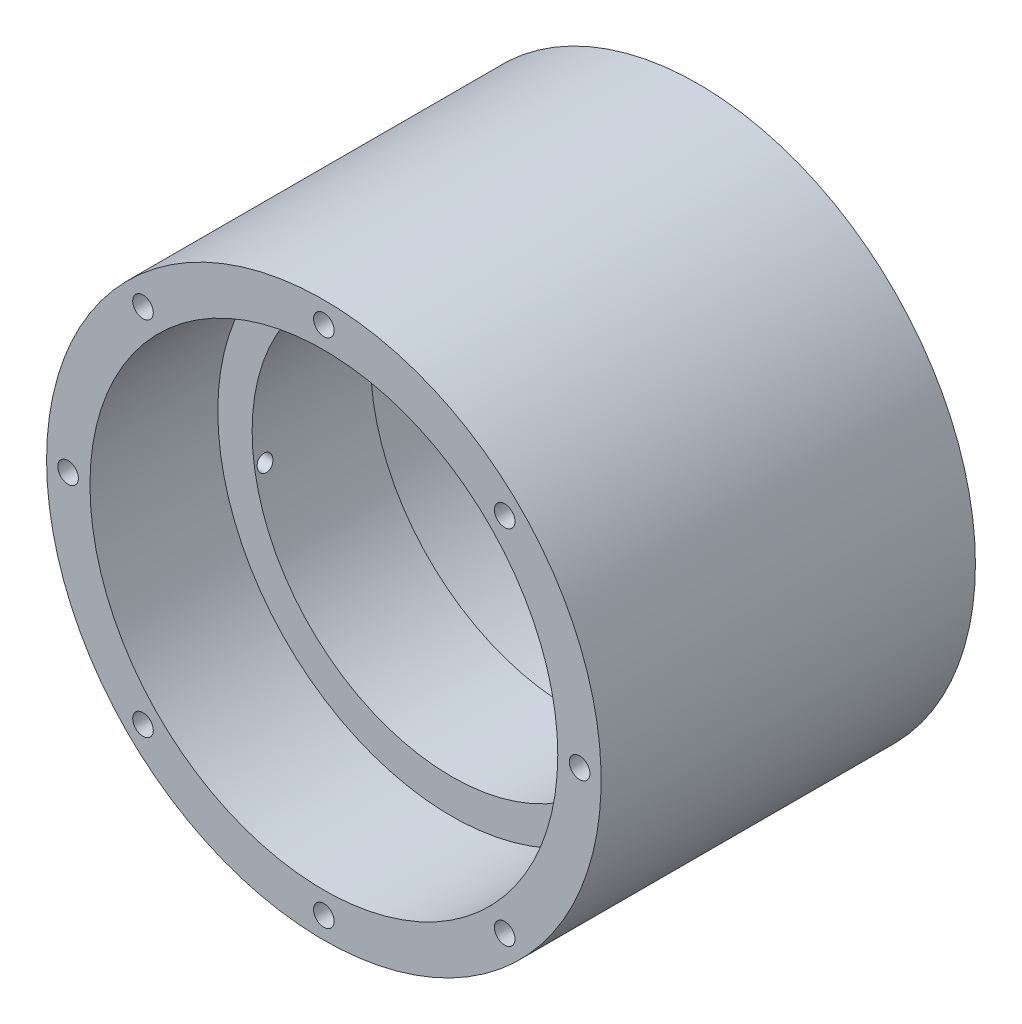
ISO-10303-21;
HEADER;
FILE_DESCRIPTION(('STEP AP214'),'2;1');
FILE_NAME('part.step','',(''),(''),'','','');
FILE_SCHEMA(('AUTOMOTIVE_DESIGN { 1 0 10303 214 1 1 1 1 }'));
ENDSEC;
DATA;
#1=APPLICATION_CONTEXT('core data for automotive mechanical design processes');
#2=APPLICATION_PROTOCOL_DEFINITION('international standard','automotive_design',2000,#1);
#3=PRODUCT_CONTEXT('',#1,'mechanical');
#4=PRODUCT('Part','Part','',(#3));
#5=PRODUCT_RELATED_PRODUCT_CATEGORY('part','',(#4));
#6=PRODUCT_DEFINITION_FORMATION('','',#4);
#7=PRODUCT_DEFINITION_CONTEXT('part definition',#1,'design');
#8=PRODUCT_DEFINITION('design','',#6,#7);
#9=PRODUCT_DEFINITION_SHAPE('','',#8);
#10=(LENGTH_UNIT() NAMED_UNIT(*) SI_UNIT(.MILLI.,.METRE.));
#11=(NAMED_UNIT(*) PLANE_ANGLE_UNIT() SI_UNIT($,.RADIAN.));
#12=(NAMED_UNIT(*) SI_UNIT($,.STERADIAN.) SOLID_ANGLE_UNIT());
#13=UNCERTAINTY_MEASURE_WITH_UNIT(LENGTH_MEASURE(1.E-05),#10,'distance_accuracy_value','');
#14=(GEOMETRIC_REPRESENTATION_CONTEXT(3) GLOBAL_UNCERTAINTY_ASSIGNED_CONTEXT((#13)) GLOBAL_UNIT_ASSIGNED_CONTEXT((#10,
#11,#12)) REPRESENTATION_CONTEXT('',''));
#15=CARTESIAN_POINT('',(0.,0.,0.));
#16=DIRECTION('',(0.,0.,1.));
#17=DIRECTION('',(1.,0.,0.));
#18=AXIS2_PLACEMENT_3D('',#15,#16,#17);
#19=CARTESIAN_POINT('',(0.,0.,60.));
#20=DIRECTION('',(0.,0.,-1.));
#21=DIRECTION('',(-1.,0.,0.));
#22=AXIS2_PLACEMENT_3D('',#19,#20,#21);
#23=CYLINDRICAL_SURFACE('',#22,44.45);
#24=DIRECTION('',(0.,0.,-1.));
#25=VECTOR('',#24,1.);
#26=CARTESIAN_POINT('',(-43.7241637998945,-7.99999999999999,50.));
#27=LINE('',#26,#25);
#28=CARTESIAN_POINT('',(-43.7241637998945,-7.99999999999999,50.));
#29=VERTEX_POINT('',#28);
#30=CARTESIAN_POINT('',(-43.7241637998945,-7.99999999999999,0.));
#31=VERTEX_POINT('',#30);
#32=EDGE_CURVE('E55',#29,#31,#27,.T.);
#33=ORIENTED_EDGE('',*,*,#32,.T.);
#34=CARTESIAN_POINT('',(0.,0.,0.));
#35=DIRECTION('',(0.,0.,-1.));
#36=DIRECTION('',(-1.,0.,0.));
#37=AXIS2_PLACEMENT_3D('',#34,#35,#36);
#38=CIRCLE('',#37,44.45);
#39=CARTESIAN_POINT('',(-43.7241637998945,7.99999999999994,0.));
#40=VERTEX_POINT('',#39);
#41=EDGE_CURVE('E42',#40,#31,#38,.T.);
#42=ORIENTED_EDGE('',*,*,#41,.F.);
#43=DIRECTION('',(0.,0.,-1.));
#44=VECTOR('',#43,1.);
#45=CARTESIAN_POINT('',(-43.7241637998945,7.99999999999998,50.));
#46=LINE('',#45,#44);
#47=CARTESIAN_POINT('',(-43.7241637998945,7.99999999999998,50.));
#48=VERTEX_POINT('',#47);
#49=EDGE_CURVE('E49',#48,#40,#46,.T.);
#50=ORIENTED_EDGE('',*,*,#49,.F.);
#51=CARTESIAN_POINT('',(0.,0.,50.));
#52=DIRECTION('',(0.,0.,-1.));
#53=DIRECTION('',(-1.,0.,0.));
#54=AXIS2_PLACEMENT_3D('',#51,#52,#53);
#55=CIRCLE('',#54,44.45);
#56=EDGE_CURVE('E65',#29,#48,#55,.T.);
#57=ORIENTED_EDGE('',*,*,#56,.F.);
#58=EDGE_LOOP('',(#33,#42,#50,#57));
#59=FACE_BOUND('',#58,.T.);
#60=CARTESIAN_POINT('',(0.,0.,60.));
#61=DIRECTION('',(0.,0.,-1.));
#62=DIRECTION('',(-1.,0.,0.));
#63=AXIS2_PLACEMENT_3D('',#60,#61,#62);
#64=CIRCLE('',#63,44.45);
#65=CARTESIAN_POINT('',(-44.45,0.,60.));
#66=VERTEX_POINT('',#65);
#67=EDGE_CURVE('E11',#66,#66,#64,.T.);
#68=ORIENTED_EDGE('',*,*,#67,.T.);
#69=EDGE_LOOP('',(#68));
#70=FACE_BOUND('',#69,.T.);
#71=ADVANCED_FACE('F35',(#59,#70),#23,.T.);
#72=CARTESIAN_POINT('',(44.45,0.,60.));
#73=DIRECTION('',(0.,0.,1.));
#74=DIRECTION('',(1.,0.,0.));
#75=AXIS2_PLACEMENT_3D('',#72,#73,#74);
#76=PLANE('',#75);
#77=CARTESIAN_POINT('',(28.9913780286488,28.9913780286481,60.));
#78=DIRECTION('',(0.,0.,1.));
#79=DIRECTION('',(1.,0.,0.));
#80=AXIS2_PLACEMENT_3D('',#77,#78,#79);
#81=CIRCLE('',#80,1.64999999999998);
#82=CARTESIAN_POINT('',(30.6413780286488,28.9913780286481,60.));
#83=VERTEX_POINT('',#82);
#84=EDGE_CURVE('E140',#83,#83,#81,.T.);
#85=ORIENTED_EDGE('',*,*,#84,.F.);
#86=EDGE_LOOP('',(#85));
#87=FACE_BOUND('',#86,.T.);
#88=CARTESIAN_POINT('',(4.29452204677705E-13,41.,60.));
#89=DIRECTION('',(0.,0.,1.));
#90=DIRECTION('',(1.,0.,0.));
#91=AXIS2_PLACEMENT_3D('',#88,#89,#90);
#92=CIRCLE('',#91,1.64999999999998);
#93=CARTESIAN_POINT('',(1.65000000000041,41.,60.));
#94=VERTEX_POINT('',#93);
#95=EDGE_CURVE('E134',#94,#94,#92,.T.);
#96=ORIENTED_EDGE('',*,*,#95,.F.);
#97=EDGE_LOOP('',(#96));
#98=FACE_BOUND('',#97,.T.);
#99=CARTESIAN_POINT('',(-28.9913780286482,28.9913780286487,60.));
#100=DIRECTION('',(0.,0.,1.));
#101=DIRECTION('',(1.,0.,0.));
#102=AXIS2_PLACEMENT_3D('',#99,#100,#101);
#103=CIRCLE('',#102,1.64999999999998);
#104=CARTESIAN_POINT('',(-27.3413780286482,28.9913780286487,60.));
#105=VERTEX_POINT('',#104);
#106=EDGE_CURVE('E128',#105,#105,#103,.T.);
#107=ORIENTED_EDGE('',*,*,#106,.F.);
#108=EDGE_LOOP('',(#107));
#109=FACE_BOUND('',#108,.T.);
#110=CARTESIAN_POINT('',(-41.,2.86301469785137E-13,60.));
#111=DIRECTION('',(0.,0.,1.));
#112=DIRECTION('',(1.,0.,0.));
#113=AXIS2_PLACEMENT_3D('',#110,#111,#112);
#114=CIRCLE('',#113,1.64999999999998);
#115=CARTESIAN_POINT('',(-39.35,2.86301469785137E-13,60.));
#116=VERTEX_POINT('',#115);
#117=EDGE_CURVE('E122',#116,#116,#114,.T.);
#118=ORIENTED_EDGE('',*,*,#117,.F.);
#119=EDGE_LOOP('',(#118));
#120=FACE_BOUND('',#119,.T.);
#121=CARTESIAN_POINT('',(-28.9913780286486,-28.9913780286483,60.));
#122=DIRECTION('',(0.,0.,1.));
#123=DIRECTION('',(1.,0.,0.));
#124=AXIS2_PLACEMENT_3D('',#121,#122,#123);
#125=CIRCLE('',#124,1.64999999999998);
#126=CARTESIAN_POINT('',(-27.3413780286486,-28.9913780286483,60.));
#127=VERTEX_POINT('',#126);
#128=EDGE_CURVE('E116',#127,#127,#125,.T.);
#129=ORIENTED_EDGE('',*,*,#128,.F.);
#130=EDGE_LOOP('',(#129));
#131=FACE_BOUND('',#130,.T.);
#132=CARTESIAN_POINT('',(-1.43150734892569E-13,-41.,60.));
#133=DIRECTION('',(0.,0.,1.));
#134=DIRECTION('',(1.,0.,0.));
#135=AXIS2_PLACEMENT_3D('',#132,#133,#134);
#136=CIRCLE('',#135,1.64999999999998);
#137=CARTESIAN_POINT('',(1.64999999999984,-41.,60.));
#138=VERTEX_POINT('',#137);
#139=EDGE_CURVE('E110',#138,#138,#136,.T.);
#140=ORIENTED_EDGE('',*,*,#139,.F.);
#141=EDGE_LOOP('',(#140));
#142=FACE_BOUND('',#141,.T.);
#143=CARTESIAN_POINT('',(28.9913780286484,-28.9913780286485,60.));
#144=DIRECTION('',(0.,0.,1.));
#145=DIRECTION('',(1.,0.,0.));
#146=AXIS2_PLACEMENT_3D('',#143,#144,#145);
#147=CIRCLE('',#146,1.64999999999998);
#148=CARTESIAN_POINT('',(30.6413780286484,-28.9913780286485,60.));
#149=VERTEX_POINT('',#148);
#150=EDGE_CURVE('E104',#149,#149,#147,.T.);
#151=ORIENTED_EDGE('',*,*,#150,.F.);
#152=EDGE_LOOP('',(#151));
#153=FACE_BOUND('',#152,.T.);
#154=CARTESIAN_POINT('',(41.,0.,60.));
#155=DIRECTION('',(0.,0.,1.));
#156=DIRECTION('',(1.,0.,0.));
#157=AXIS2_PLACEMENT_3D('',#154,#155,#156);
#158=CIRCLE('',#157,1.64999999999998);
#159=CARTESIAN_POINT('',(42.65,0.,60.));
#160=VERTEX_POINT('',#159);
#161=EDGE_CURVE('E98',#160,#160,#158,.T.);
#162=ORIENTED_EDGE('',*,*,#161,.F.);
#163=EDGE_LOOP('',(#162));
#164=FACE_BOUND('',#163,.T.);
#165=CARTESIAN_POINT('',(0.,0.,60.));
#166=DIRECTION('',(0.,0.,-1.));
#167=DIRECTION('',(-1.,0.,0.));
#168=AXIS2_PLACEMENT_3D('',#165,#166,#167);
#169=CIRCLE('',#168,37.5);
#170=CARTESIAN_POINT('',(-37.5,0.,60.));
#171=VERTEX_POINT('',#170);
#172=EDGE_CURVE('E66',#171,#171,#169,.T.);
#173=ORIENTED_EDGE('',*,*,#172,.T.);
#174=EDGE_LOOP('',(#173));
#175=FACE_BOUND('',#174,.T.);
#176=ORIENTED_EDGE('',*,*,#67,.F.);
#177=EDGE_LOOP('',(#176));
#178=FACE_BOUND('',#177,.T.);
#179=ADVANCED_FACE('F188',(#87,#98,#109,#120,#131,#142,#153,#164,#175,#178),#76,.T.);
#180=CARTESIAN_POINT('',(0.,0.,0.));
#181=DIRECTION('',(0.,0.,-1.));
#182=DIRECTION('',(-1.,0.,0.));
#183=AXIS2_PLACEMENT_3D('',#180,#181,#182);
#184=PLANE('',#183);
#185=CARTESIAN_POINT('',(0.,0.,0.));
#186=DIRECTION('',(0.,0.,-1.));
#187=DIRECTION('',(-1.,0.,0.));
#188=AXIS2_PLACEMENT_3D('',#185,#186,#187);
#189=CIRCLE('',#188,37.5);
#190=CARTESIAN_POINT('',(-37.5,0.,0.));
#191=VERTEX_POINT('',#190);
#192=EDGE_CURVE('E80',#191,#191,#189,.T.);
#193=ORIENTED_EDGE('',*,*,#192,.F.);
#194=EDGE_LOOP('',(#193));
#195=FACE_BOUND('',#194,.T.);
#196=DIRECTION('',(0.,-1.,0.));
#197=VECTOR('',#196,1.);
#198=CARTESIAN_POINT('',(-43.7241637998945,7.99999999999998,0.));
#199=LINE('',#198,#197);
#200=EDGE_CURVE('E60',#40,#31,#199,.T.);
#201=ORIENTED_EDGE('',*,*,#200,.F.);
#202=ORIENTED_EDGE('',*,*,#41,.T.);
#203=EDGE_LOOP('',(#201,#202));
#204=FACE_BOUND('',#203,.T.);
#205=ADVANCED_FACE('F72',(#195,#204),#184,.T.);
#206=CARTESIAN_POINT('',(-43.7241637998945,7.99999999999998,50.));
#207=DIRECTION('',(1.,0.,0.));
#208=DIRECTION('',(0.,1.,0.));
#209=AXIS2_PLACEMENT_3D('',#206,#207,#208);
#210=PLANE('',#209);
#211=CARTESIAN_POINT('',(-43.7241637998945,-5.05000000000007,37.8347480327554));
#212=DIRECTION('',(-1.,0.,0.));
#213=DIRECTION('',(0.,0.,1.));
#214=AXIS2_PLACEMENT_3D('',#211,#212,#213);
#215=CIRCLE('',#214,1.24999999999999);
#216=CARTESIAN_POINT('',(-43.7241637998945,-5.05000000000007,39.0847480327554));
#217=VERTEX_POINT('',#216);
#218=EDGE_CURVE('E169',#217,#217,#215,.T.);
#219=ORIENTED_EDGE('',*,*,#218,.F.);
#220=EDGE_LOOP('',(#219));
#221=FACE_BOUND('',#220,.T.);
#222=CARTESIAN_POINT('',(-43.7241637998945,5.14999999999991,15.5847480327554));
#223=DIRECTION('',(-1.,0.,0.));
#224=DIRECTION('',(0.,0.,1.));
#225=AXIS2_PLACEMENT_3D('',#222,#223,#224);
#226=CIRCLE('',#225,1.24999999999999);
#227=CARTESIAN_POINT('',(-43.7241637998945,5.14999999999991,16.8347480327554));
#228=VERTEX_POINT('',#227);
#229=EDGE_CURVE('E150',#228,#228,#226,.T.);
#230=ORIENTED_EDGE('',*,*,#229,.F.);
#231=EDGE_LOOP('',(#230));
#232=FACE_BOUND('',#231,.T.);
#233=ORIENTED_EDGE('',*,*,#200,.T.);
#234=ORIENTED_EDGE('',*,*,#32,.F.);
#235=DIRECTION('',(0.,-1.,0.));
#236=VECTOR('',#235,1.);
#237=CARTESIAN_POINT('',(-43.7241637998945,7.99999999999998,50.));
#238=LINE('',#237,#236);
#239=EDGE_CURVE('E74',#48,#29,#238,.T.);
#240=ORIENTED_EDGE('',*,*,#239,.F.);
#241=ORIENTED_EDGE('',*,*,#49,.T.);
#242=EDGE_LOOP('',(#233,#234,#240,#241));
#243=FACE_BOUND('',#242,.T.);
#244=ADVANCED_FACE('F61',(#221,#232,#243),#210,.F.);
#245=CARTESIAN_POINT('',(0.,0.,50.));
#246=DIRECTION('',(0.,0.,-1.));
#247=DIRECTION('',(-1.,0.,0.));
#248=AXIS2_PLACEMENT_3D('',#245,#246,#247);
#249=PLANE('',#248);
#250=ORIENTED_EDGE('',*,*,#56,.T.);
#251=ORIENTED_EDGE('',*,*,#239,.T.);
#252=EDGE_LOOP('',(#250,#251));
#253=FACE_BOUND('',#252,.T.);
#254=ADVANCED_FACE('F176',(#253),#249,.T.);
#255=CARTESIAN_POINT('',(0.,0.,60.));
#256=DIRECTION('',(0.,0.,-1.));
#257=DIRECTION('',(-1.,0.,0.));
#258=AXIS2_PLACEMENT_3D('',#255,#256,#257);
#259=CYLINDRICAL_SURFACE('',#258,37.5);
#260=ORIENTED_EDGE('',*,*,#172,.F.);
#261=EDGE_LOOP('',(#260));
#262=FACE_BOUND('',#261,.T.);
#263=CARTESIAN_POINT('',(0.,0.,39.5));
#264=DIRECTION('',(0.,0.,-1.));
#265=DIRECTION('',(-1.,0.,0.));
#266=AXIS2_PLACEMENT_3D('',#263,#264,#265);
#267=CIRCLE('',#266,37.5);
#268=CARTESIAN_POINT('',(-37.5,0.,39.5));
#269=VERTEX_POINT('',#268);
#270=EDGE_CURVE('E92',#269,#269,#267,.T.);
#271=ORIENTED_EDGE('',*,*,#270,.T.);
#272=EDGE_LOOP('',(#271));
#273=FACE_BOUND('',#272,.T.);
#274=ADVANCED_FACE('F185',(#262,#273),#259,.F.);
#275=CARTESIAN_POINT('',(0.,0.,60.));
#276=DIRECTION('',(0.,0.,-1.));
#277=DIRECTION('',(-1.,0.,0.));
#278=AXIS2_PLACEMENT_3D('',#275,#276,#277);
#279=CYLINDRICAL_SURFACE('',#278,37.5);
#280=CARTESIAN_POINT('',(-37.144683334227,5.14999999999991,16.8347480327554));
#281=CARTESIAN_POINT('',(-37.1348528911148,5.22090051073942,16.8347449450375));
#282=CARTESIAN_POINT('',(-37.1248106513063,5.29182459819324,16.8286963232049));
#283=CARTESIAN_POINT('',(-37.1046086195653,5.43166899050378,16.8046693009774));
#284=CARTESIAN_POINT('',(-37.0944486964647,5.50058668172742,16.7866760082665));
#285=CARTESIAN_POINT('',(-37.0743616385239,5.63438406331942,16.7392631093398));
#286=CARTESIAN_POINT('',(-37.0644344074721,5.69926544161951,16.7098483172179));
#287=CARTESIAN_POINT('',(-37.0451732269609,5.82314994177625,16.6404046422333));
#288=CARTESIAN_POINT('',(-37.0358391210029,5.88215461657673,16.6003785737378));
#289=CARTESIAN_POINT('',(-37.0181484620944,5.99247897915528,16.510902512055));
#290=CARTESIAN_POINT('',(-37.0097898163284,6.04381518822893,16.4614733158417));
#291=CARTESIAN_POINT('',(-36.994379464664,6.13743799182848,16.3544997378289));
#292=CARTESIAN_POINT('',(-36.9873277433184,6.17972469331536,16.2969554519593));
#293=CARTESIAN_POINT('',(-36.9749153479508,6.25356115348532,16.1760328728788));
#294=CARTESIAN_POINT('',(-36.9695374310235,6.28522067548756,16.1127233902448));
#295=CARTESIAN_POINT('',(-36.9606212604343,6.33744290485986,15.9815612417574));
#296=CARTESIAN_POINT('',(-36.9570828495687,6.35800656048572,15.9137089646897));
#297=CARTESIAN_POINT('',(-36.9520492466531,6.38719617492573,15.7763487578726));
#298=CARTESIAN_POINT('',(-36.9505277219078,6.39597600407855,15.7068744677431));
#299=CARTESIAN_POINT('',(-36.9495145861352,6.40182641977568,15.5674216524102));
#300=CARTESIAN_POINT('',(-36.9500228646396,6.39889764353856,15.4974431548543));
#301=CARTESIAN_POINT('',(-36.9530336945292,6.38148698474805,15.3594951754045));
#302=CARTESIAN_POINT('',(-36.9555219470029,6.36708793701472,15.2915148995373));
#303=CARTESIAN_POINT('',(-36.9623580246327,6.3272817010028,15.1589581923875));
#304=CARTESIAN_POINT('',(-36.9667058695097,6.30187439598112,15.0943817972114));
#305=CARTESIAN_POINT('',(-36.9770827601659,6.24069803024955,14.970184866816));
#306=CARTESIAN_POINT('',(-36.983118082518,6.20489026534491,14.9105839338025));
#307=CARTESIAN_POINT('',(-36.9965981456411,6.12400209385604,14.798228800226));
#308=CARTESIAN_POINT('',(-37.0040429693984,6.07892114128647,14.745475003106));
#309=CARTESIAN_POINT('',(-37.0201292159303,5.98018050394595,14.6476308799104));
#310=CARTESIAN_POINT('',(-37.0287839028091,5.92642453564731,14.6026399100731));
#311=CARTESIAN_POINT('',(-37.0468765562931,5.81225203153841,14.522300033647));
#312=CARTESIAN_POINT('',(-37.0563145776811,5.75183502978858,14.4869518021697));
#313=CARTESIAN_POINT('',(-37.0757453062318,5.62523391871104,14.4264584466028));
#314=CARTESIAN_POINT('',(-37.0857434329323,5.55898768513162,14.4014450215018));
#315=CARTESIAN_POINT('',(-37.105837369471,5.42324059699343,14.3629388696798));
#316=CARTESIAN_POINT('',(-37.1159331832372,5.35373961112239,14.3494466082008));
#317=CARTESIAN_POINT('',(-37.1359611780551,5.21300936433585,14.3343211631203));
#318=CARTESIAN_POINT('',(-37.1458920406966,5.14177232097843,14.3327584832582));
#319=CARTESIAN_POINT('',(-37.1652413669283,4.99999535897765,14.3417501007413));
#320=CARTESIAN_POINT('',(-37.1746598327812,4.9294554372568,14.3523043445714));
#321=CARTESIAN_POINT('',(-37.1927245810604,4.79125109340386,14.3852338469232));
#322=CARTESIAN_POINT('',(-37.2013725018675,4.72358073868491,14.4075832890255));
#323=CARTESIAN_POINT('',(-37.2177300857738,4.59291914330473,14.4634942945913));
#324=CARTESIAN_POINT('',(-37.2254397815039,4.52992773994223,14.4970554679657));
#325=CARTESIAN_POINT('',(-37.2397305630399,4.41090027827992,14.5741909051058));
#326=CARTESIAN_POINT('',(-37.2463192036033,4.35481842717962,14.617693101265));
#327=CARTESIAN_POINT('',(-37.2583397294966,4.25074937895236,14.713624643073));
#328=CARTESIAN_POINT('',(-37.2637716609072,4.20276185938029,14.7660536329475));
#329=CARTESIAN_POINT('',(-37.2733846739309,4.1166326816723,14.877925374925));
#330=CARTESIAN_POINT('',(-37.2775748230358,4.07841994392651,14.9373126302776));
#331=CARTESIAN_POINT('',(-37.2847278907407,4.0125017603857,15.0617249423557));
#332=CARTESIAN_POINT('',(-37.2876908482523,3.98479598144007,15.1267498202451));
#333=CARTESIAN_POINT('',(-37.2923630418455,3.94083091658892,15.260216685987));
#334=CARTESIAN_POINT('',(-37.294078885748,3.92451131982482,15.3286385808647));
#335=CARTESIAN_POINT('',(-37.2962777184731,3.90356006865423,15.4672682188042));
#336=CARTESIAN_POINT('',(-37.2967607269552,3.89892822786913,15.5374759333703));
#337=CARTESIAN_POINT('',(-37.2964933123858,3.90148533965298,15.6774920819659));
#338=CARTESIAN_POINT('',(-37.2957460548888,3.90864395463081,15.7473010783946));
#339=CARTESIAN_POINT('',(-37.2930256755793,3.93451432165206,15.8847193049675));
#340=CARTESIAN_POINT('',(-37.2910525577753,3.95322603591851,15.9523285423038));
#341=CARTESIAN_POINT('',(-37.285886575909,4.00165607824829,16.0834365931672));
#342=CARTESIAN_POINT('',(-37.282693640832,4.03137504712507,16.1469351671293));
#343=CARTESIAN_POINT('',(-37.2751046064624,4.10095060576332,16.2680278489174));
#344=CARTESIAN_POINT('',(-37.2707085462307,4.14080686640329,16.3256221483487));
#345=CARTESIAN_POINT('',(-37.2607349755815,4.22961286855187,16.433439906076));
#346=CARTESIAN_POINT('',(-37.2551544982269,4.27858540752631,16.4836443077821));
#347=CARTESIAN_POINT('',(-37.2428785516507,4.3841550189487,16.5751323321814));
#348=CARTESIAN_POINT('',(-37.2361827842689,4.44075412949945,16.6164135625664));
#349=CARTESIAN_POINT('',(-37.221733265501,4.56028678918127,16.6891315414998));
#350=CARTESIAN_POINT('',(-37.2139735623147,4.62325540998598,16.7205093741549));
#351=CARTESIAN_POINT('',(-37.197572847733,4.75340502453666,16.7722266841077));
#352=CARTESIAN_POINT('',(-37.1889328518474,4.82058113078725,16.792578713305));
#353=CARTESIAN_POINT('',(-37.1743078287966,4.93180720303172,16.8163415002608));
#354=CARTESIAN_POINT('',(-37.1685297672093,4.97517127671192,16.8232375260162));
#355=CARTESIAN_POINT('',(-37.1567558924915,5.0623538965539,16.8324417518367));
#356=CARTESIAN_POINT('',(-37.1507600788648,5.1061724437512,16.8347499414459));
#357=CARTESIAN_POINT('',(-37.144683334227,5.14999999999991,16.8347480327554));
#358=B_SPLINE_CURVE_WITH_KNOTS('',3,(#280,#281,#282,#283,#284,#285,#286,#287,#288,#289,#290,
#291,#292,#293,#294,#295,#296,#297,#298,#299,#300,#301,#302,#303,#304,#305,#306,#307,#308,#309,
#310,#311,#312,#313,#314,#315,#316,#317,#318,#319,#320,#321,#322,#323,#324,#325,#326,#327,#328,
#329,#330,#331,#332,#333,#334,#335,#336,#337,#338,#339,#340,#341,#342,#343,#344,#345,#346,#347,
#348,#349,#350,#351,#352,#353,#354,#355,#356,#357),.UNSPECIFIED.,.T.,.F.,(4,2,2,2,2,2,2,2,2,2,2,
2,2,2,2,2,2,2,2,2,2,2,2,2,2,2,2,2,2,2,2,2,2,2,2,2,2,2,4),(0.,0.214574812460327,
0.429417655127943,0.644170040946635,0.858865526122726,1.07309157499613,1.28731509167714,
1.49925252902309,1.71117185126716,1.92029614915831,2.12940906601248,2.33702537581528,
2.54464388745263,2.75304515124104,2.96145868876162,3.17236847438735,3.38329302253361,
3.59682818625758,3.81037197244642,4.02517683103878,4.23998074093472,4.45431644257557,
4.66864468762418,4.88146585846975,5.09427854938609,5.30549666204981,5.51670807693056,
5.72679206547084,5.9368727038889,6.1464136354944,6.35595388193475,6.56550632917573,
6.77505197386892,6.98512885488301,7.19526198798583,7.40662262819543,7.61774214472134,
7.7503824900707,7.88302313771301),.UNSPECIFIED.);
#359=CARTESIAN_POINT('',(-37.144683334227,5.14999999999991,16.8347480327554));
#360=VERTEX_POINT('',#359);
#361=EDGE_CURVE('E143',#360,#360,#358,.T.);
#362=ORIENTED_EDGE('',*,*,#361,.T.);
#363=EDGE_LOOP('',(#362));
#364=FACE_BOUND('',#363,.T.);
#365=CARTESIAN_POINT('',(0.,0.,20.5));
#366=DIRECTION('',(0.,0.,-1.));
#367=DIRECTION('',(-1.,0.,0.));
#368=AXIS2_PLACEMENT_3D('',#365,#366,#367);
#369=CIRCLE('',#368,37.5);
#370=CARTESIAN_POINT('',(-37.5,0.,20.5));
#371=VERTEX_POINT('',#370);
#372=EDGE_CURVE('E83',#371,#371,#369,.T.);
#373=ORIENTED_EDGE('',*,*,#372,.F.);
#374=EDGE_LOOP('',(#373));
#375=FACE_BOUND('',#374,.T.);
#376=ORIENTED_EDGE('',*,*,#192,.T.);
#377=EDGE_LOOP('',(#376));
#378=FACE_BOUND('',#377,.T.);
#379=ADVANCED_FACE('F220',(#364,#375,#378),#279,.F.);
#380=CARTESIAN_POINT('',(37.5,0.,20.5));
#381=DIRECTION('',(0.,0.,1.));
#382=DIRECTION('',(1.,0.,0.));
#383=AXIS2_PLACEMENT_3D('',#380,#381,#382);
#384=PLANE('',#383);
#385=CARTESIAN_POINT('',(0.,0.,20.5));
#386=DIRECTION('',(0.,0.,-1.));
#387=DIRECTION('',(-1.,0.,0.));
#388=AXIS2_PLACEMENT_3D('',#385,#386,#387);
#389=CIRCLE('',#388,32.);
#390=CARTESIAN_POINT('',(-32.,0.,20.5));
#391=VERTEX_POINT('',#390);
#392=EDGE_CURVE('E86',#391,#391,#389,.T.);
#393=ORIENTED_EDGE('',*,*,#392,.F.);
#394=EDGE_LOOP('',(#393));
#395=FACE_BOUND('',#394,.T.);
#396=ORIENTED_EDGE('',*,*,#372,.T.);
#397=EDGE_LOOP('',(#396));
#398=FACE_BOUND('',#397,.T.);
#399=ADVANCED_FACE('F234',(#395,#398),#384,.F.);
#400=CARTESIAN_POINT('',(0.,0.,60.));
#401=DIRECTION('',(0.,0.,-1.));
#402=DIRECTION('',(-1.,0.,0.));
#403=AXIS2_PLACEMENT_3D('',#400,#401,#402);
#404=CYLINDRICAL_SURFACE('',#403,32.);
#405=CARTESIAN_POINT('',(-31.5990110604746,-5.05000000000007,39.0847480327554));
#406=CARTESIAN_POINT('',(-31.6102891033159,-4.97942858720738,39.0847450608575));
#407=CARTESIAN_POINT('',(-31.6213366783599,-4.90877038482601,39.0787530651163));
#408=CARTESIAN_POINT('',(-31.6426713540702,-4.76931246784278,39.0548829999618));
#409=CARTESIAN_POINT('',(-31.6529575908903,-4.70051491890359,39.0369916520221));
#410=CARTESIAN_POINT('',(-31.6725244643878,-4.56681061042861,38.9897598570429));
#411=CARTESIAN_POINT('',(-31.6818051551345,-4.50190364177588,38.960420025992));
#412=CARTESIAN_POINT('',(-31.6991778737891,-4.37790436767826,38.8910777595899));
#413=CARTESIAN_POINT('',(-31.7072702117634,-4.31881054679376,38.8510781133037));
#414=CARTESIAN_POINT('',(-31.722087434473,-4.20859167579249,38.7618521571332));
#415=CARTESIAN_POINT('',(-31.728821994585,-4.15741089639364,38.7126963098968));
#416=CARTESIAN_POINT('',(-31.7409188447558,-4.06402436722578,38.6063434898743));
#417=CARTESIAN_POINT('',(-31.7462811485182,-4.02181852783235,38.5491465973963));
#418=CARTESIAN_POINT('',(-31.7555456181635,-3.94799936908926,38.4289076926337));
#419=CARTESIAN_POINT('',(-31.7594607788446,-3.91629205986199,38.3659243746026));
#420=CARTESIAN_POINT('',(-31.7658792481159,-3.86388624562626,38.235466162245));
#421=CARTESIAN_POINT('',(-31.7683826098751,-3.84318732603793,38.1679914371741));
#422=CARTESIAN_POINT('',(-31.7719593765968,-3.81350518594546,38.0308898226099));
#423=CARTESIAN_POINT('',(-31.7730410413861,-3.80445429874435,37.9612777909705));
#424=CARTESIAN_POINT('',(-31.7737995783917,-3.7981141654517,37.8215131287053));
#425=CARTESIAN_POINT('',(-31.7734764776757,-3.80082469273531,37.7513605085219));
#426=CARTESIAN_POINT('',(-31.7714283201624,-3.81790710734191,37.6126717390764));
#427=CARTESIAN_POINT('',(-31.7697064129067,-3.83225279691034,37.5441323139243));
#428=CARTESIAN_POINT('',(-31.7648685060241,-3.87214788568633,37.4104484346043));
#429=CARTESIAN_POINT('',(-31.7617525086584,-3.89769726672187,37.34530397493));
#430=CARTESIAN_POINT('',(-31.7541345343057,-3.95928008695441,37.2201769576665));
#431=CARTESIAN_POINT('',(-31.7496310724579,-3.99532475590018,37.1602000187676));
#432=CARTESIAN_POINT('',(-31.7392682252595,-4.0768289820651,37.0471607802378));
#433=CARTESIAN_POINT('',(-31.733408820624,-4.12228867318841,36.9940985789686));
#434=CARTESIAN_POINT('',(-31.7203600243388,-4.22152456574871,36.8961256809254));
#435=CARTESIAN_POINT('',(-31.7131647446278,-4.27533740571379,36.8512528875535));
#436=CARTESIAN_POINT('',(-31.6975551512946,-4.38956895748419,36.7711705720993));
#437=CARTESIAN_POINT('',(-31.6891407933419,-4.44998790949477,36.7359614015601));
#438=CARTESIAN_POINT('',(-31.6711594588842,-4.57621572932684,36.6758894999452));
#439=CARTESIAN_POINT('',(-31.6615837440788,-4.64206409235134,36.6511123929175));
#440=CARTESIAN_POINT('',(-31.6415287335983,-4.77685042253994,36.6129476285321));
#441=CARTESIAN_POINT('',(-31.6310493872883,-4.84578856273535,36.5995606098744));
#442=CARTESIAN_POINT('',(-31.609325115038,-4.98554060871946,36.5844140839569));
#443=CARTESIAN_POINT('',(-31.5980734734273,-5.05636647246416,36.5827745060373));
#444=CARTESIAN_POINT('',(-31.5752108488912,-5.19722548019936,36.5914441175516));
#445=CARTESIAN_POINT('',(-31.5635998453115,-5.26725857830859,36.6017539950256));
#446=CARTESIAN_POINT('',(-31.5402806677472,-5.4051481109854,36.6341539980978));
#447=CARTESIAN_POINT('',(-31.5285724713679,-5.47298221490968,36.6563392345689));
#448=CARTESIAN_POINT('',(-31.505556714952,-5.60395588744305,36.7119415119903));
#449=CARTESIAN_POINT('',(-31.4942491635228,-5.66709535522659,36.7453587940836));
#450=CARTESIAN_POINT('',(-31.4724600537168,-5.7868790795586,36.8225299746293));
#451=CARTESIAN_POINT('',(-31.4619785808262,-5.84352266416094,36.8662849410008));
#452=CARTESIAN_POINT('',(-31.4422734825977,-5.94863881470916,36.9629422502653));
#453=CARTESIAN_POINT('',(-31.433049793713,-5.9971117934869,37.0158441307232));
#454=CARTESIAN_POINT('',(-31.4163623768435,-6.08392251317164,37.1286917037353));
#455=CARTESIAN_POINT('',(-31.4088802354395,-6.12236686618559,37.1885526163383));
#456=CARTESIAN_POINT('',(-31.3958935952915,-6.18861944999391,37.3140931974283));
#457=CARTESIAN_POINT('',(-31.3903888793575,-6.21642884889723,37.3797722258956));
#458=CARTESIAN_POINT('',(-31.3817042582696,-6.26012208309218,37.5138325814496));
#459=CARTESIAN_POINT('',(-31.3784847912082,-6.27620899388857,37.5821451768007));
#460=CARTESIAN_POINT('',(-31.3743716959006,-6.29673826280625,37.7205650304702));
#461=CARTESIAN_POINT('',(-31.3734778592658,-6.30118166424754,37.7906721274232));
#462=CARTESIAN_POINT('',(-31.3740562876324,-6.29830080588364,37.9296985415372));
#463=CARTESIAN_POINT('',(-31.3754972964885,-6.29113199695902,37.9986212707544));
#464=CARTESIAN_POINT('',(-31.3806162831636,-6.26554783436723,38.1342582281655));
#465=CARTESIAN_POINT('',(-31.3842942360331,-6.24713260613572,38.2009724809826));
#466=CARTESIAN_POINT('',(-31.3937139314897,-6.19962160994403,38.3303499302796));
#467=CARTESIAN_POINT('',(-31.3994564146972,-6.17052200904079,38.3930116634468));
#468=CARTESIAN_POINT('',(-31.4127425869514,-6.10252392848839,38.5125553358801));
#469=CARTESIAN_POINT('',(-31.4202863180386,-6.06362522013086,38.5694371402008));
#470=CARTESIAN_POINT('',(-31.4369607266685,-5.97657802420914,38.6766413739151));
#471=CARTESIAN_POINT('',(-31.4461113125776,-5.92831258708006,38.7268657066191));
#472=CARTESIAN_POINT('',(-31.465552072119,-5.82424501402477,38.8185443696361));
#473=CARTESIAN_POINT('',(-31.4758426247834,-5.76844036999579,38.8599957695885));
#474=CARTESIAN_POINT('',(-31.4973575872857,-5.64979312328791,38.9337088700856));
#475=CARTESIAN_POINT('',(-31.5085954842139,-5.58684181270976,38.9657915019498));
#476=CARTESIAN_POINT('',(-31.5314201033916,-5.45654692219903,39.0188757689499));
#477=CARTESIAN_POINT('',(-31.5430064337641,-5.38920818407186,39.039889394269));
#478=CARTESIAN_POINT('',(-31.5620549458802,-5.27624155277635,39.0649456578556));
#479=CARTESIAN_POINT('',(-31.5695300613221,-5.23133520131989,39.0723601082684));
#480=CARTESIAN_POINT('',(-31.5843724065202,-5.14096459584863,39.082262276057));
#481=CARTESIAN_POINT('',(-31.5917396352997,-5.09550033679039,39.0847499488621));
#482=CARTESIAN_POINT('',(-31.5990110604746,-5.05000000000007,39.0847480327554));
#483=B_SPLINE_CURVE_WITH_KNOTS('',3,(#405,#406,#407,#408,#409,#410,#411,#412,#413,#414,#415,
#416,#417,#418,#419,#420,#421,#422,#423,#424,#425,#426,#427,#428,#429,#430,#431,#432,#433,#434,
#435,#436,#437,#438,#439,#440,#441,#442,#443,#444,#445,#446,#447,#448,#449,#450,#451,#452,#453,
#454,#455,#456,#457,#458,#459,#460,#461,#462,#463,#464,#465,#466,#467,#468,#469,#470,#471,#472,
#473,#474,#475,#476,#477,#478,#479,#480,#481,#482),.UNSPECIFIED.,.T.,.F.,(4,2,2,2,2,2,2,2,2,2,2,
2,2,2,2,2,2,2,2,2,2,2,2,2,2,2,2,2,2,2,2,2,2,2,2,2,2,2,4),(0.,0.214234628204967,
0.428708723549192,0.643171280651084,0.857577780143764,1.0703977816709,1.28321565786225,
1.49407320299883,1.70492280660286,1.91454191287912,2.124156980127,2.33330138361533,
2.54244544787962,2.75181411965184,2.96118576935257,3.17150316081169,3.38182820217962,
3.59384739249409,3.80587847101542,4.02007112515877,4.23427611295918,4.45022293605879,
4.66617439565587,4.8821481735586,5.0981110357957,5.31167472382463,5.52521494796715,
5.73496173973722,5.94468973644323,6.15163326600327,6.35857448748431,6.56559002031548,
6.77261038527797,6.98240449965126,7.19226857985572,7.40591461079638,7.61932873742055,
7.7574534988043,7.89557950974457),.UNSPECIFIED.);
#484=CARTESIAN_POINT('',(-31.5990110604746,-5.05000000000007,39.0847480327554));
#485=VERTEX_POINT('',#484);
#486=EDGE_CURVE('E164',#485,#485,#483,.T.);
#487=ORIENTED_EDGE('',*,*,#486,.T.);
#488=EDGE_LOOP('',(#487));
#489=FACE_BOUND('',#488,.T.);
#490=CARTESIAN_POINT('',(0.,0.,39.5));
#491=DIRECTION('',(0.,0.,-1.));
#492=DIRECTION('',(-1.,0.,0.));
#493=AXIS2_PLACEMENT_3D('',#490,#491,#492);
#494=CIRCLE('',#493,32.);
#495=CARTESIAN_POINT('',(-32.,0.,39.5));
#496=VERTEX_POINT('',#495);
#497=EDGE_CURVE('E89',#496,#496,#494,.T.);
#498=ORIENTED_EDGE('',*,*,#497,.F.);
#499=EDGE_LOOP('',(#498));
#500=FACE_BOUND('',#499,.T.);
#501=ORIENTED_EDGE('',*,*,#392,.T.);
#502=EDGE_LOOP('',(#501));
#503=FACE_BOUND('',#502,.T.);
#504=ADVANCED_FACE('F228',(#489,#500,#503),#404,.F.);
#505=CARTESIAN_POINT('',(32.,0.,39.5));
#506=DIRECTION('',(0.,0.,-1.));
#507=DIRECTION('',(-1.,0.,0.));
#508=AXIS2_PLACEMENT_3D('',#505,#506,#507);
#509=PLANE('',#508);
#510=ORIENTED_EDGE('',*,*,#270,.F.);
#511=EDGE_LOOP('',(#510));
#512=FACE_BOUND('',#511,.T.);
#513=ORIENTED_EDGE('',*,*,#497,.T.);
#514=EDGE_LOOP('',(#513));
#515=FACE_BOUND('',#514,.T.);
#516=ADVANCED_FACE('F224',(#512,#515),#509,.F.);
#517=CARTESIAN_POINT('',(41.,0.,52.));
#518=DIRECTION('',(0.,0.,-1.));
#519=DIRECTION('',(-1.,0.,0.));
#520=AXIS2_PLACEMENT_3D('',#517,#518,#519);
#521=PLANE('',#520);
#522=CARTESIAN_POINT('',(41.,0.,52.));
#523=DIRECTION('',(0.,0.,1.));
#524=DIRECTION('',(1.,0.,0.));
#525=AXIS2_PLACEMENT_3D('',#522,#523,#524);
#526=CIRCLE('',#525,1.64999999999998);
#527=CARTESIAN_POINT('',(42.65,0.,52.));
#528=VERTEX_POINT('',#527);
#529=EDGE_CURVE('E95',#528,#528,#526,.T.);
#530=ORIENTED_EDGE('',*,*,#529,.T.);
#531=EDGE_LOOP('',(#530));
#532=FACE_BOUND('',#531,.T.);
#533=ADVANCED_FACE('F227',(#532),#521,.F.);
#534=CARTESIAN_POINT('',(41.,0.,60.));
#535=DIRECTION('',(0.,0.,1.));
#536=DIRECTION('',(1.,0.,0.));
#537=AXIS2_PLACEMENT_3D('',#534,#535,#536);
#538=CYLINDRICAL_SURFACE('',#537,1.64999999999998);
#539=ORIENTED_EDGE('',*,*,#529,.F.);
#540=EDGE_LOOP('',(#539));
#541=FACE_BOUND('',#540,.T.);
#542=ORIENTED_EDGE('',*,*,#161,.T.);
#543=EDGE_LOOP('',(#542));
#544=FACE_BOUND('',#543,.T.);
#545=ADVANCED_FACE('F254',(#541,#544),#538,.F.);
#546=CARTESIAN_POINT('',(28.9913780286484,-28.9913780286485,52.));
#547=DIRECTION('',(0.,0.,-1.));
#548=DIRECTION('',(-1.,0.,0.));
#549=AXIS2_PLACEMENT_3D('',#546,#547,#548);
#550=PLANE('',#549);
#551=CARTESIAN_POINT('',(28.9913780286484,-28.9913780286485,52.));
#552=DIRECTION('',(0.,0.,1.));
#553=DIRECTION('',(1.,0.,0.));
#554=AXIS2_PLACEMENT_3D('',#551,#552,#553);
#555=CIRCLE('',#554,1.64999999999998);
#556=CARTESIAN_POINT('',(30.6413780286484,-28.9913780286485,52.));
#557=VERTEX_POINT('',#556);
#558=EDGE_CURVE('E101',#557,#557,#555,.T.);
#559=ORIENTED_EDGE('',*,*,#558,.T.);
#560=EDGE_LOOP('',(#559));
#561=FACE_BOUND('',#560,.T.);
#562=ADVANCED_FACE('F258',(#561),#550,.F.);
#563=CARTESIAN_POINT('',(28.9913780286484,-28.9913780286485,60.));
#564=DIRECTION('',(0.,0.,1.));
#565=DIRECTION('',(1.,0.,0.));
#566=AXIS2_PLACEMENT_3D('',#563,#564,#565);
#567=CYLINDRICAL_SURFACE('',#566,1.64999999999998);
#568=ORIENTED_EDGE('',*,*,#558,.F.);
#569=EDGE_LOOP('',(#568));
#570=FACE_BOUND('',#569,.T.);
#571=ORIENTED_EDGE('',*,*,#150,.T.);
#572=EDGE_LOOP('',(#571));
#573=FACE_BOUND('',#572,.T.);
#574=ADVANCED_FACE('F262',(#570,#573),#567,.F.);
#575=CARTESIAN_POINT('',(-1.45110169771204E-13,-41.,52.));
#576=DIRECTION('',(0.,0.,-1.));
#577=DIRECTION('',(-1.,0.,0.));
#578=AXIS2_PLACEMENT_3D('',#575,#576,#577);
#579=PLANE('',#578);
#580=CARTESIAN_POINT('',(-1.43150734892569E-13,-41.,52.));
#581=DIRECTION('',(0.,0.,1.));
#582=DIRECTION('',(1.,0.,0.));
#583=AXIS2_PLACEMENT_3D('',#580,#581,#582);
#584=CIRCLE('',#583,1.64999999999998);
#585=CARTESIAN_POINT('',(1.64999999999984,-41.,52.));
#586=VERTEX_POINT('',#585);
#587=EDGE_CURVE('E107',#586,#586,#584,.T.);
#588=ORIENTED_EDGE('',*,*,#587,.T.);
#589=EDGE_LOOP('',(#588));
#590=FACE_BOUND('',#589,.T.);
#591=ADVANCED_FACE('F266',(#590),#579,.F.);
#592=CARTESIAN_POINT('',(-1.43150734892569E-13,-41.,60.));
#593=DIRECTION('',(0.,0.,1.));
#594=DIRECTION('',(1.,0.,0.));
#595=AXIS2_PLACEMENT_3D('',#592,#593,#594);
#596=CYLINDRICAL_SURFACE('',#595,1.64999999999998);
#597=ORIENTED_EDGE('',*,*,#587,.F.);
#598=EDGE_LOOP('',(#597));
#599=FACE_BOUND('',#598,.T.);
#600=ORIENTED_EDGE('',*,*,#139,.T.);
#601=EDGE_LOOP('',(#600));
#602=FACE_BOUND('',#601,.T.);
#603=ADVANCED_FACE('F270',(#599,#602),#596,.F.);
#604=CARTESIAN_POINT('',(-28.9913780286486,-28.9913780286483,52.));
#605=DIRECTION('',(0.,0.,-1.));
#606=DIRECTION('',(-1.,0.,0.));
#607=AXIS2_PLACEMENT_3D('',#604,#605,#606);
#608=PLANE('',#607);
#609=CARTESIAN_POINT('',(-28.9913780286486,-28.9913780286483,52.));
#610=DIRECTION('',(0.,0.,1.));
#611=DIRECTION('',(1.,0.,0.));
#612=AXIS2_PLACEMENT_3D('',#609,#610,#611);
#613=CIRCLE('',#612,1.64999999999998);
#614=CARTESIAN_POINT('',(-27.3413780286486,-28.9913780286483,52.));
#615=VERTEX_POINT('',#614);
#616=EDGE_CURVE('E113',#615,#615,#613,.T.);
#617=ORIENTED_EDGE('',*,*,#616,.T.);
#618=EDGE_LOOP('',(#617));
#619=FACE_BOUND('',#618,.T.);
#620=ADVANCED_FACE('F274',(#619),#608,.F.);
#621=CARTESIAN_POINT('',(-28.9913780286486,-28.9913780286483,60.));
#622=DIRECTION('',(0.,0.,1.));
#623=DIRECTION('',(1.,0.,0.));
#624=AXIS2_PLACEMENT_3D('',#621,#622,#623);
#625=CYLINDRICAL_SURFACE('',#624,1.64999999999998);
#626=ORIENTED_EDGE('',*,*,#616,.F.);
#627=EDGE_LOOP('',(#626));
#628=FACE_BOUND('',#627,.T.);
#629=ORIENTED_EDGE('',*,*,#128,.T.);
#630=EDGE_LOOP('',(#629));
#631=FACE_BOUND('',#630,.T.);
#632=ADVANCED_FACE('F278',(#628,#631),#625,.F.);
#633=CARTESIAN_POINT('',(-41.,2.86301469785137E-13,52.));
#634=DIRECTION('',(0.,0.,-1.));
#635=DIRECTION('',(-1.,0.,0.));
#636=AXIS2_PLACEMENT_3D('',#633,#634,#635);
#637=PLANE('',#636);
#638=CARTESIAN_POINT('',(-41.,2.86301469785137E-13,52.));
#639=DIRECTION('',(0.,0.,1.));
#640=DIRECTION('',(1.,0.,0.));
#641=AXIS2_PLACEMENT_3D('',#638,#639,#640);
#642=CIRCLE('',#641,1.64999999999998);
#643=CARTESIAN_POINT('',(-39.35,2.86301469785137E-13,52.));
#644=VERTEX_POINT('',#643);
#645=EDGE_CURVE('E119',#644,#644,#642,.T.);
#646=ORIENTED_EDGE('',*,*,#645,.T.);
#647=EDGE_LOOP('',(#646));
#648=FACE_BOUND('',#647,.T.);
#649=ADVANCED_FACE('F282',(#648),#637,.F.);
#650=CARTESIAN_POINT('',(-41.,2.86301469785137E-13,60.));
#651=DIRECTION('',(0.,0.,1.));
#652=DIRECTION('',(1.,0.,0.));
#653=AXIS2_PLACEMENT_3D('',#650,#651,#652);
#654=CYLINDRICAL_SURFACE('',#653,1.64999999999998);
#655=ORIENTED_EDGE('',*,*,#645,.F.);
#656=EDGE_LOOP('',(#655));
#657=FACE_BOUND('',#656,.T.);
#658=ORIENTED_EDGE('',*,*,#117,.T.);
#659=EDGE_LOOP('',(#658));
#660=FACE_BOUND('',#659,.T.);
#661=ADVANCED_FACE('F286',(#657,#660),#654,.F.);
#662=CARTESIAN_POINT('',(-28.9913780286482,28.9913780286487,52.));
#663=DIRECTION('',(0.,0.,-1.));
#664=DIRECTION('',(-1.,0.,0.));
#665=AXIS2_PLACEMENT_3D('',#662,#663,#664);
#666=PLANE('',#665);
#667=CARTESIAN_POINT('',(-28.9913780286482,28.9913780286487,52.));
#668=DIRECTION('',(0.,0.,1.));
#669=DIRECTION('',(1.,0.,0.));
#670=AXIS2_PLACEMENT_3D('',#667,#668,#669);
#671=CIRCLE('',#670,1.64999999999998);
#672=CARTESIAN_POINT('',(-27.3413780286482,28.9913780286487,52.));
#673=VERTEX_POINT('',#672);
#674=EDGE_CURVE('E125',#673,#673,#671,.T.);
#675=ORIENTED_EDGE('',*,*,#674,.T.);
#676=EDGE_LOOP('',(#675));
#677=FACE_BOUND('',#676,.T.);
#678=ADVANCED_FACE('F290',(#677),#666,.F.);
#679=CARTESIAN_POINT('',(-28.9913780286482,28.9913780286487,60.));
#680=DIRECTION('',(0.,0.,1.));
#681=DIRECTION('',(1.,0.,0.));
#682=AXIS2_PLACEMENT_3D('',#679,#680,#681);
#683=CYLINDRICAL_SURFACE('',#682,1.64999999999998);
#684=ORIENTED_EDGE('',*,*,#674,.F.);
#685=EDGE_LOOP('',(#684));
#686=FACE_BOUND('',#685,.T.);
#687=ORIENTED_EDGE('',*,*,#106,.T.);
#688=EDGE_LOOP('',(#687));
#689=FACE_BOUND('',#688,.T.);
#690=ADVANCED_FACE('F294',(#686,#689),#683,.F.);
#691=CARTESIAN_POINT('',(4.2749276979907E-13,41.,52.));
#692=DIRECTION('',(0.,0.,-1.));
#693=DIRECTION('',(-1.,0.,0.));
#694=AXIS2_PLACEMENT_3D('',#691,#692,#693);
#695=PLANE('',#694);
#696=CARTESIAN_POINT('',(4.29452204677705E-13,41.,52.));
#697=DIRECTION('',(0.,0.,1.));
#698=DIRECTION('',(1.,0.,0.));
#699=AXIS2_PLACEMENT_3D('',#696,#697,#698);
#700=CIRCLE('',#699,1.64999999999998);
#701=CARTESIAN_POINT('',(1.65000000000041,41.,52.));
#702=VERTEX_POINT('',#701);
#703=EDGE_CURVE('E131',#702,#702,#700,.T.);
#704=ORIENTED_EDGE('',*,*,#703,.T.);
#705=EDGE_LOOP('',(#704));
#706=FACE_BOUND('',#705,.T.);
#707=ADVANCED_FACE('F298',(#706),#695,.F.);
#708=CARTESIAN_POINT('',(4.29452204677705E-13,41.,60.));
#709=DIRECTION('',(0.,0.,1.));
#710=DIRECTION('',(1.,0.,0.));
#711=AXIS2_PLACEMENT_3D('',#708,#709,#710);
#712=CYLINDRICAL_SURFACE('',#711,1.64999999999998);
#713=ORIENTED_EDGE('',*,*,#703,.F.);
#714=EDGE_LOOP('',(#713));
#715=FACE_BOUND('',#714,.T.);
#716=ORIENTED_EDGE('',*,*,#95,.T.);
#717=EDGE_LOOP('',(#716));
#718=FACE_BOUND('',#717,.T.);
#719=ADVANCED_FACE('F302',(#715,#718),#712,.F.);
#720=CARTESIAN_POINT('',(28.9913780286488,28.9913780286481,52.));
#721=DIRECTION('',(0.,0.,-1.));
#722=DIRECTION('',(-1.,0.,0.));
#723=AXIS2_PLACEMENT_3D('',#720,#721,#722);
#724=PLANE('',#723);
#725=CARTESIAN_POINT('',(28.9913780286488,28.9913780286481,52.));
#726=DIRECTION('',(0.,0.,1.));
#727=DIRECTION('',(1.,0.,0.));
#728=AXIS2_PLACEMENT_3D('',#725,#726,#727);
#729=CIRCLE('',#728,1.64999999999998);
#730=CARTESIAN_POINT('',(30.6413780286488,28.9913780286481,52.));
#731=VERTEX_POINT('',#730);
#732=EDGE_CURVE('E137',#731,#731,#729,.T.);
#733=ORIENTED_EDGE('',*,*,#732,.T.);
#734=EDGE_LOOP('',(#733));
#735=FACE_BOUND('',#734,.T.);
#736=ADVANCED_FACE('F306',(#735),#724,.F.);
#737=CARTESIAN_POINT('',(28.9913780286488,28.9913780286481,60.));
#738=DIRECTION('',(0.,0.,1.));
#739=DIRECTION('',(1.,0.,0.));
#740=AXIS2_PLACEMENT_3D('',#737,#738,#739);
#741=CYLINDRICAL_SURFACE('',#740,1.64999999999998);
#742=ORIENTED_EDGE('',*,*,#732,.F.);
#743=EDGE_LOOP('',(#742));
#744=FACE_BOUND('',#743,.T.);
#745=ORIENTED_EDGE('',*,*,#84,.T.);
#746=EDGE_LOOP('',(#745));
#747=FACE_BOUND('',#746,.T.);
#748=ADVANCED_FACE('F159',(#744,#747),#741,.F.);
#749=CARTESIAN_POINT('',(-43.7241637998945,5.14999999999991,15.5847480327554));
#750=DIRECTION('',(-1.,0.,0.));
#751=DIRECTION('',(0.,0.,1.));
#752=AXIS2_PLACEMENT_3D('',#749,#750,#751);
#753=CYLINDRICAL_SURFACE('',#752,1.24999999999999);
#754=ORIENTED_EDGE('',*,*,#361,.F.);
#755=EDGE_LOOP('',(#754));
#756=FACE_BOUND('',#755,.T.);
#757=ORIENTED_EDGE('',*,*,#229,.T.);
#758=EDGE_LOOP('',(#757));
#759=FACE_BOUND('',#758,.T.);
#760=ADVANCED_FACE('F154',(#756,#759),#753,.F.);
#761=CARTESIAN_POINT('',(-43.7241637998945,-5.05000000000007,37.8347480327554));
#762=DIRECTION('',(-1.,0.,0.));
#763=DIRECTION('',(0.,0.,1.));
#764=AXIS2_PLACEMENT_3D('',#761,#762,#763);
#765=CYLINDRICAL_SURFACE('',#764,1.24999999999999);
#766=ORIENTED_EDGE('',*,*,#486,.F.);
#767=EDGE_LOOP('',(#766));
#768=FACE_BOUND('',#767,.T.);
#769=ORIENTED_EDGE('',*,*,#218,.T.);
#770=EDGE_LOOP('',(#769));
#771=FACE_BOUND('',#770,.T.);
#772=ADVANCED_FACE('F158',(#768,#771),#765,.F.);
#773=CLOSED_SHELL('',(#71,#179,#205,#244,#254,#274,#379,#399,#504,#516,#533,#545,#562,#574,#591,
#603,#620,#632,#649,#661,#678,#690,#707,#719,#736,#748,#760,#772));
#774=MANIFOLD_SOLID_BREP('B2',#773);
#775=ADVANCED_BREP_SHAPE_REPRESENTATION('',(#18,#774),#14);
#776=SHAPE_DEFINITION_REPRESENTATION(#9,#775);
ENDSEC;
END-ISO-10303-21;
